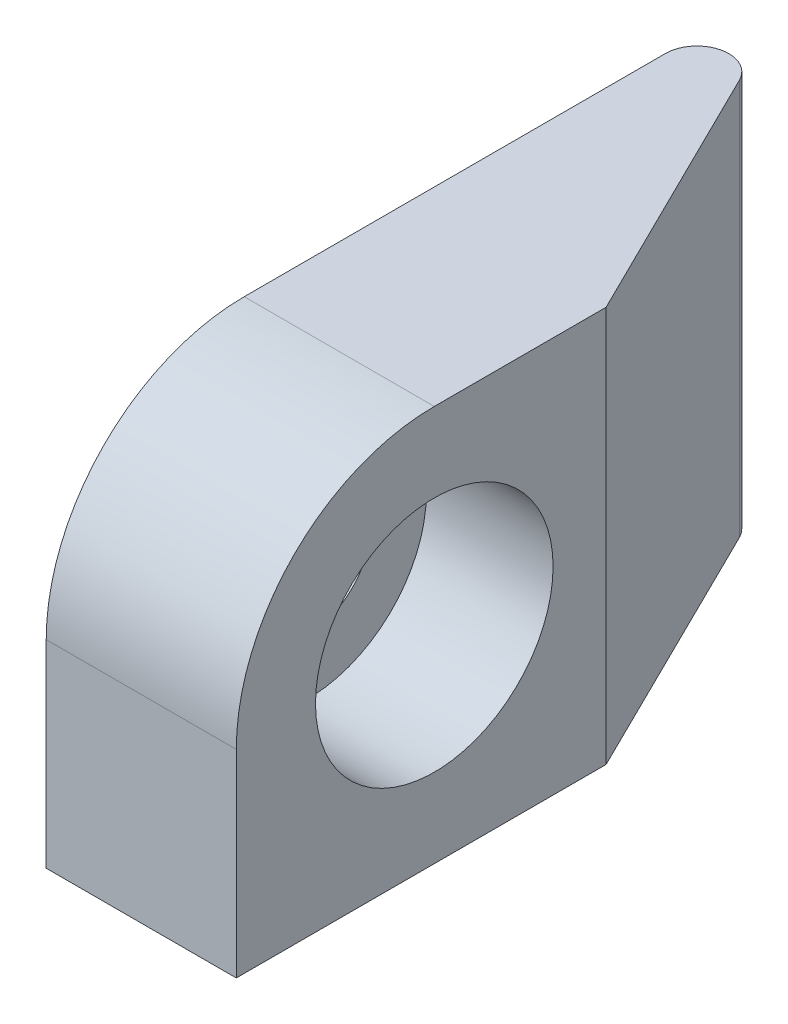
ISO-10303-21;
HEADER;
FILE_DESCRIPTION(('STEP AP214'),'2;1');
FILE_NAME('part.step','',(''),(''),'','','');
FILE_SCHEMA(('AUTOMOTIVE_DESIGN { 1 0 10303 214 1 1 1 1 }'));
ENDSEC;
DATA;
#1=APPLICATION_CONTEXT('core data for automotive mechanical design processes');
#2=APPLICATION_PROTOCOL_DEFINITION('international standard','automotive_design',2000,#1);
#3=PRODUCT_CONTEXT('',#1,'mechanical');
#4=PRODUCT('Part','Part','',(#3));
#5=PRODUCT_RELATED_PRODUCT_CATEGORY('part','',(#4));
#6=PRODUCT_DEFINITION_FORMATION('','',#4);
#7=PRODUCT_DEFINITION_CONTEXT('part definition',#1,'design');
#8=PRODUCT_DEFINITION('design','',#6,#7);
#9=PRODUCT_DEFINITION_SHAPE('','',#8);
#10=(LENGTH_UNIT() NAMED_UNIT(*) SI_UNIT(.MILLI.,.METRE.));
#11=(NAMED_UNIT(*) PLANE_ANGLE_UNIT() SI_UNIT($,.RADIAN.));
#12=(NAMED_UNIT(*) SI_UNIT($,.STERADIAN.) SOLID_ANGLE_UNIT());
#13=UNCERTAINTY_MEASURE_WITH_UNIT(LENGTH_MEASURE(1.E-05),#10,'distance_accuracy_value','');
#14=(GEOMETRIC_REPRESENTATION_CONTEXT(3) GLOBAL_UNCERTAINTY_ASSIGNED_CONTEXT((#13)) GLOBAL_UNIT_ASSIGNED_CONTEXT((#10,
#11,#12)) REPRESENTATION_CONTEXT('',''));
#15=CARTESIAN_POINT('',(0.,0.,0.));
#16=DIRECTION('',(0.,0.,1.));
#17=DIRECTION('',(1.,0.,0.));
#18=AXIS2_PLACEMENT_3D('',#15,#16,#17);
#19=CARTESIAN_POINT('',(0.,0.,0.));
#20=DIRECTION('',(1.,0.,0.));
#21=DIRECTION('',(0.,0.,-1.));
#22=AXIS2_PLACEMENT_3D('',#19,#20,#21);
#23=PLANE('',#22);
#24=DIRECTION('',(0.,0.,1.));
#25=VECTOR('',#24,1.);
#26=CARTESIAN_POINT('',(0.,12.5,-42.));
#27=LINE('',#26,#25);
#28=CARTESIAN_POINT('',(0.,12.5,-26.5873371241312));
#29=VERTEX_POINT('',#28);
#30=CARTESIAN_POINT('',(0.,12.5,0.));
#31=VERTEX_POINT('',#30);
#32=EDGE_CURVE('E118',#29,#31,#27,.T.);
#33=ORIENTED_EDGE('',*,*,#32,.F.);
#34=DIRECTION('',(0.,1.,0.));
#35=VECTOR('',#34,1.);
#36=CARTESIAN_POINT('',(0.,0.,-26.5873371241312));
#37=LINE('',#36,#35);
#38=CARTESIAN_POINT('',(0.,-12.5,-26.5873371241312));
#39=VERTEX_POINT('',#38);
#40=EDGE_CURVE('E51',#29,#39,#37,.F.);
#41=ORIENTED_EDGE('',*,*,#40,.T.);
#42=DIRECTION('',(0.,0.,-1.));
#43=VECTOR('',#42,1.);
#44=CARTESIAN_POINT('',(0.,-12.5,0.));
#45=LINE('',#44,#43);
#46=CARTESIAN_POINT('',(0.,-12.5,12.5));
#47=VERTEX_POINT('',#46);
#48=EDGE_CURVE('E134',#47,#39,#45,.T.);
#49=ORIENTED_EDGE('',*,*,#48,.F.);
#50=DIRECTION('',(0.,-1.,0.));
#51=VECTOR('',#50,1.);
#52=CARTESIAN_POINT('',(0.,0.,12.5));
#53=LINE('',#52,#51);
#54=CARTESIAN_POINT('',(0.,0.,12.5));
#55=VERTEX_POINT('',#54);
#56=EDGE_CURVE('E141',#55,#47,#53,.T.);
#57=ORIENTED_EDGE('',*,*,#56,.F.);
#58=CARTESIAN_POINT('',(0.,0.,0.));
#59=DIRECTION('',(1.,0.,0.));
#60=DIRECTION('',(0.,0.,-1.));
#61=AXIS2_PLACEMENT_3D('',#58,#59,#60);
#62=CIRCLE('',#61,12.5);
#63=EDGE_CURVE('E127',#31,#55,#62,.T.);
#64=ORIENTED_EDGE('',*,*,#63,.F.);
#65=EDGE_LOOP('',(#33,#41,#49,#57,#64));
#66=FACE_BOUND('',#65,.T.);
#67=CARTESIAN_POINT('',(0.,0.,0.));
#68=DIRECTION('',(1.,0.,0.));
#69=DIRECTION('',(0.,0.,-1.));
#70=AXIS2_PLACEMENT_3D('',#67,#68,#69);
#71=CIRCLE('',#70,4.);
#72=CARTESIAN_POINT('',(0.,0.,-4.));
#73=VERTEX_POINT('',#72);
#74=EDGE_CURVE('E120',#73,#73,#71,.T.);
#75=ORIENTED_EDGE('',*,*,#74,.T.);
#76=EDGE_LOOP('',(#75));
#77=FACE_BOUND('',#76,.T.);
#78=ADVANCED_FACE('F43',(#66,#77),#23,.F.);
#79=CARTESIAN_POINT('',(12.,0.,0.));
#80=DIRECTION('',(1.,0.,0.));
#81=DIRECTION('',(0.,0.,-1.));
#82=AXIS2_PLACEMENT_3D('',#79,#80,#81);
#83=PLANE('',#82);
#84=DIRECTION('',(0.,1.,0.));
#85=VECTOR('',#84,1.);
#86=CARTESIAN_POINT('',(12.,-12.501,-10.8475198655951));
#87=LINE('',#86,#85);
#88=CARTESIAN_POINT('',(12.,-12.5,-10.8475198655951));
#89=VERTEX_POINT('',#88);
#90=CARTESIAN_POINT('',(12.,12.5,-10.8475198655951));
#91=VERTEX_POINT('',#90);
#92=EDGE_CURVE('E98',#89,#91,#87,.T.);
#93=ORIENTED_EDGE('',*,*,#92,.T.);
#94=DIRECTION('',(0.,0.,1.));
#95=VECTOR('',#94,1.);
#96=CARTESIAN_POINT('',(12.,12.5,-42.));
#97=LINE('',#96,#95);
#98=CARTESIAN_POINT('',(12.,12.5,0.));
#99=VERTEX_POINT('',#98);
#100=EDGE_CURVE('E108',#91,#99,#97,.T.);
#101=ORIENTED_EDGE('',*,*,#100,.T.);
#102=CARTESIAN_POINT('',(12.,0.,0.));
#103=DIRECTION('',(1.,0.,0.));
#104=DIRECTION('',(0.,0.,-1.));
#105=AXIS2_PLACEMENT_3D('',#102,#103,#104);
#106=CIRCLE('',#105,12.5);
#107=CARTESIAN_POINT('',(12.,0.,12.5));
#108=VERTEX_POINT('',#107);
#109=EDGE_CURVE('E133',#99,#108,#106,.T.);
#110=ORIENTED_EDGE('',*,*,#109,.T.);
#111=DIRECTION('',(0.,-1.,0.));
#112=VECTOR('',#111,1.);
#113=CARTESIAN_POINT('',(12.,0.,12.5));
#114=LINE('',#113,#112);
#115=CARTESIAN_POINT('',(12.,-12.5,12.5));
#116=VERTEX_POINT('',#115);
#117=EDGE_CURVE('E136',#108,#116,#114,.T.);
#118=ORIENTED_EDGE('',*,*,#117,.T.);
#119=DIRECTION('',(0.,0.,-1.));
#120=VECTOR('',#119,1.);
#121=CARTESIAN_POINT('',(12.,-12.5,0.));
#122=LINE('',#121,#120);
#123=EDGE_CURVE('E111',#116,#89,#122,.T.);
#124=ORIENTED_EDGE('',*,*,#123,.T.);
#125=EDGE_LOOP('',(#93,#101,#110,#118,#124));
#126=FACE_BOUND('',#125,.T.);
#127=CARTESIAN_POINT('',(12.,0.,0.));
#128=DIRECTION('',(1.,0.,0.));
#129=DIRECTION('',(0.,0.,-1.));
#130=AXIS2_PLACEMENT_3D('',#127,#128,#129);
#131=CIRCLE('',#130,7.5);
#132=CARTESIAN_POINT('',(12.,0.,-7.5));
#133=VERTEX_POINT('',#132);
#134=EDGE_CURVE('E130',#133,#133,#131,.T.);
#135=ORIENTED_EDGE('',*,*,#134,.F.);
#136=EDGE_LOOP('',(#135));
#137=FACE_BOUND('',#136,.T.);
#138=ADVANCED_FACE('F106',(#126,#137),#83,.T.);
#139=CARTESIAN_POINT('',(12.,0.,0.));
#140=DIRECTION('',(-1.,0.,0.));
#141=DIRECTION('',(0.,0.,1.));
#142=AXIS2_PLACEMENT_3D('',#139,#140,#141);
#143=CYLINDRICAL_SURFACE('',#142,12.5);
#144=DIRECTION('',(-1.,0.,0.));
#145=VECTOR('',#144,1.);
#146=CARTESIAN_POINT('',(0.,12.5,0.));
#147=LINE('',#146,#145);
#148=EDGE_CURVE('E117',#99,#31,#147,.T.);
#149=ORIENTED_EDGE('',*,*,#148,.T.);
#150=ORIENTED_EDGE('',*,*,#63,.T.);
#151=DIRECTION('',(-1.,0.,0.));
#152=VECTOR('',#151,1.);
#153=CARTESIAN_POINT('',(12.,0.,12.5));
#154=LINE('',#153,#152);
#155=EDGE_CURVE('E146',#108,#55,#154,.T.);
#156=ORIENTED_EDGE('',*,*,#155,.F.);
#157=ORIENTED_EDGE('',*,*,#109,.F.);
#158=EDGE_LOOP('',(#149,#150,#156,#157));
#159=FACE_BOUND('',#158,.T.);
#160=ADVANCED_FACE('F161',(#159),#143,.T.);
#161=CARTESIAN_POINT('',(12.,0.,0.));
#162=DIRECTION('',(-1.,0.,0.));
#163=DIRECTION('',(0.,0.,1.));
#164=AXIS2_PLACEMENT_3D('',#161,#162,#163);
#165=CYLINDRICAL_SURFACE('',#164,7.5);
#166=ORIENTED_EDGE('',*,*,#134,.T.);
#167=EDGE_LOOP('',(#166));
#168=FACE_BOUND('',#167,.T.);
#169=CARTESIAN_POINT('',(4.,0.,0.));
#170=DIRECTION('',(1.,0.,0.));
#171=DIRECTION('',(0.,0.,-1.));
#172=AXIS2_PLACEMENT_3D('',#169,#170,#171);
#173=CIRCLE('',#172,7.5);
#174=CARTESIAN_POINT('',(4.,0.,-7.5));
#175=VERTEX_POINT('',#174);
#176=EDGE_CURVE('E149',#175,#175,#173,.T.);
#177=ORIENTED_EDGE('',*,*,#176,.F.);
#178=EDGE_LOOP('',(#177));
#179=FACE_BOUND('',#178,.T.);
#180=ADVANCED_FACE('F158',(#168,#179),#165,.F.);
#181=CARTESIAN_POINT('',(4.,0.,0.));
#182=DIRECTION('',(-1.,0.,0.));
#183=DIRECTION('',(0.,0.,1.));
#184=AXIS2_PLACEMENT_3D('',#181,#182,#183);
#185=CYLINDRICAL_SURFACE('',#184,4.);
#186=CARTESIAN_POINT('',(4.,0.,0.));
#187=DIRECTION('',(1.,0.,0.));
#188=DIRECTION('',(0.,0.,-1.));
#189=AXIS2_PLACEMENT_3D('',#186,#187,#188);
#190=CIRCLE('',#189,4.);
#191=CARTESIAN_POINT('',(4.,0.,-4.));
#192=VERTEX_POINT('',#191);
#193=EDGE_CURVE('E124',#192,#192,#190,.T.);
#194=ORIENTED_EDGE('',*,*,#193,.T.);
#195=EDGE_LOOP('',(#194));
#196=FACE_BOUND('',#195,.T.);
#197=ORIENTED_EDGE('',*,*,#74,.F.);
#198=EDGE_LOOP('',(#197));
#199=FACE_BOUND('',#198,.T.);
#200=ADVANCED_FACE('F160',(#196,#199),#185,.F.);
#201=CARTESIAN_POINT('',(4.,0.,0.));
#202=DIRECTION('',(1.,0.,0.));
#203=DIRECTION('',(0.,0.,-1.));
#204=AXIS2_PLACEMENT_3D('',#201,#202,#203);
#205=PLANE('',#204);
#206=ORIENTED_EDGE('',*,*,#176,.T.);
#207=EDGE_LOOP('',(#206));
#208=FACE_BOUND('',#207,.T.);
#209=ORIENTED_EDGE('',*,*,#193,.F.);
#210=EDGE_LOOP('',(#209));
#211=FACE_BOUND('',#210,.T.);
#212=ADVANCED_FACE('F155',(#208,#211),#205,.T.);
#213=CARTESIAN_POINT('',(12.,0.,12.5));
#214=DIRECTION('',(0.,0.,-1.));
#215=DIRECTION('',(0.,1.,0.));
#216=AXIS2_PLACEMENT_3D('',#213,#214,#215);
#217=PLANE('',#216);
#218=ORIENTED_EDGE('',*,*,#56,.T.);
#219=DIRECTION('',(-1.,0.,0.));
#220=VECTOR('',#219,1.);
#221=CARTESIAN_POINT('',(12.,-12.5,12.5));
#222=LINE('',#221,#220);
#223=EDGE_CURVE('E139',#116,#47,#222,.T.);
#224=ORIENTED_EDGE('',*,*,#223,.F.);
#225=ORIENTED_EDGE('',*,*,#117,.F.);
#226=ORIENTED_EDGE('',*,*,#155,.T.);
#227=EDGE_LOOP('',(#218,#224,#225,#226));
#228=FACE_BOUND('',#227,.T.);
#229=ADVANCED_FACE('F182',(#228),#217,.F.);
#230=CARTESIAN_POINT('',(12.,-12.5,0.));
#231=DIRECTION('',(0.,1.,0.));
#232=DIRECTION('',(0.,0.,1.));
#233=AXIS2_PLACEMENT_3D('',#230,#231,#232);
#234=PLANE('',#233);
#235=ORIENTED_EDGE('',*,*,#48,.T.);
#236=CARTESIAN_POINT('',(2.,-12.5,-26.5873371241312));
#237=DIRECTION('',(0.,1.,0.));
#238=DIRECTION('',(0.,0.,1.));
#239=AXIS2_PLACEMENT_3D('',#236,#237,#238);
#240=CIRCLE('',#239,2.);
#241=CARTESIAN_POINT('',(3.79340257232769,-12.5,-27.4726095192551));
#242=VERTEX_POINT('',#241);
#243=EDGE_CURVE('E11',#39,#242,#240,.F.);
#244=ORIENTED_EDGE('',*,*,#243,.T.);
#245=DIRECTION('',(-0.442636197561957,0.,-0.896701286163844));
#246=VECTOR('',#245,1.);
#247=CARTESIAN_POINT('',(0.,-12.5,-35.1573605275983));
#248=LINE('',#247,#246);
#249=EDGE_CURVE('E112',#89,#242,#248,.T.);
#250=ORIENTED_EDGE('',*,*,#249,.F.);
#251=ORIENTED_EDGE('',*,*,#123,.F.);
#252=ORIENTED_EDGE('',*,*,#223,.T.);
#253=EDGE_LOOP('',(#235,#244,#250,#251,#252));
#254=FACE_BOUND('',#253,.T.);
#255=ADVANCED_FACE('F179',(#254),#234,.F.);
#256=CARTESIAN_POINT('',(0.,12.5,-42.));
#257=DIRECTION('',(0.,1.,0.));
#258=DIRECTION('',(0.,0.,1.));
#259=AXIS2_PLACEMENT_3D('',#256,#257,#258);
#260=PLANE('',#259);
#261=DIRECTION('',(0.442636197561957,0.,0.896701286163844));
#262=VECTOR('',#261,1.);
#263=CARTESIAN_POINT('',(0.,12.5,-35.1573605275983));
#264=LINE('',#263,#262);
#265=CARTESIAN_POINT('',(3.79340257232769,12.5,-27.4726095192551));
#266=VERTEX_POINT('',#265);
#267=EDGE_CURVE('E94',#266,#91,#264,.T.);
#268=ORIENTED_EDGE('',*,*,#267,.F.);
#269=CARTESIAN_POINT('',(2.,12.5,-26.5873371241312));
#270=DIRECTION('',(0.,1.,0.));
#271=DIRECTION('',(0.,0.,1.));
#272=AXIS2_PLACEMENT_3D('',#269,#270,#271);
#273=CIRCLE('',#272,2.);
#274=EDGE_CURVE('E65',#266,#29,#273,.T.);
#275=ORIENTED_EDGE('',*,*,#274,.T.);
#276=ORIENTED_EDGE('',*,*,#32,.T.);
#277=ORIENTED_EDGE('',*,*,#148,.F.);
#278=ORIENTED_EDGE('',*,*,#100,.F.);
#279=EDGE_LOOP('',(#268,#275,#276,#277,#278));
#280=FACE_BOUND('',#279,.T.);
#281=ADVANCED_FACE('F115',(#280),#260,.T.);
#282=CARTESIAN_POINT('',(0.,-12.501,-35.1573605275983));
#283=DIRECTION('',(-0.896701286163844,0.,0.442636197561957));
#284=DIRECTION('',(0.442636197561957,0.,0.896701286163844));
#285=AXIS2_PLACEMENT_3D('',#282,#283,#284);
#286=PLANE('',#285);
#287=ORIENTED_EDGE('',*,*,#249,.T.);
#288=DIRECTION('',(0.,1.,0.));
#289=VECTOR('',#288,1.);
#290=CARTESIAN_POINT('',(3.79340257232769,-12.501,-27.4726095192551));
#291=LINE('',#290,#289);
#292=EDGE_CURVE('E101',#242,#266,#291,.T.);
#293=ORIENTED_EDGE('',*,*,#292,.T.);
#294=ORIENTED_EDGE('',*,*,#267,.T.);
#295=ORIENTED_EDGE('',*,*,#92,.F.);
#296=EDGE_LOOP('',(#287,#293,#294,#295));
#297=FACE_BOUND('',#296,.T.);
#298=ADVANCED_FACE('F97',(#297),#286,.F.);
#299=CARTESIAN_POINT('',(2.,-12.501,-26.5873371241312));
#300=DIRECTION('',(0.,1.,0.));
#301=DIRECTION('',(0.,0.,1.));
#302=AXIS2_PLACEMENT_3D('',#299,#300,#301);
#303=CYLINDRICAL_SURFACE('',#302,2.);
#304=ORIENTED_EDGE('',*,*,#243,.F.);
#305=ORIENTED_EDGE('',*,*,#40,.F.);
#306=ORIENTED_EDGE('',*,*,#274,.F.);
#307=ORIENTED_EDGE('',*,*,#292,.F.);
#308=EDGE_LOOP('',(#304,#305,#306,#307));
#309=FACE_BOUND('',#308,.T.);
#310=ADVANCED_FACE('F45',(#309),#303,.T.);
#311=CLOSED_SHELL('',(#78,#138,#160,#180,#200,#212,#229,#255,#281,#298,#310));
#312=MANIFOLD_SOLID_BREP('B2',#311);
#313=ADVANCED_BREP_SHAPE_REPRESENTATION('',(#18,#312),#14);
#314=SHAPE_DEFINITION_REPRESENTATION(#9,#313);
ENDSEC;
END-ISO-10303-21;
